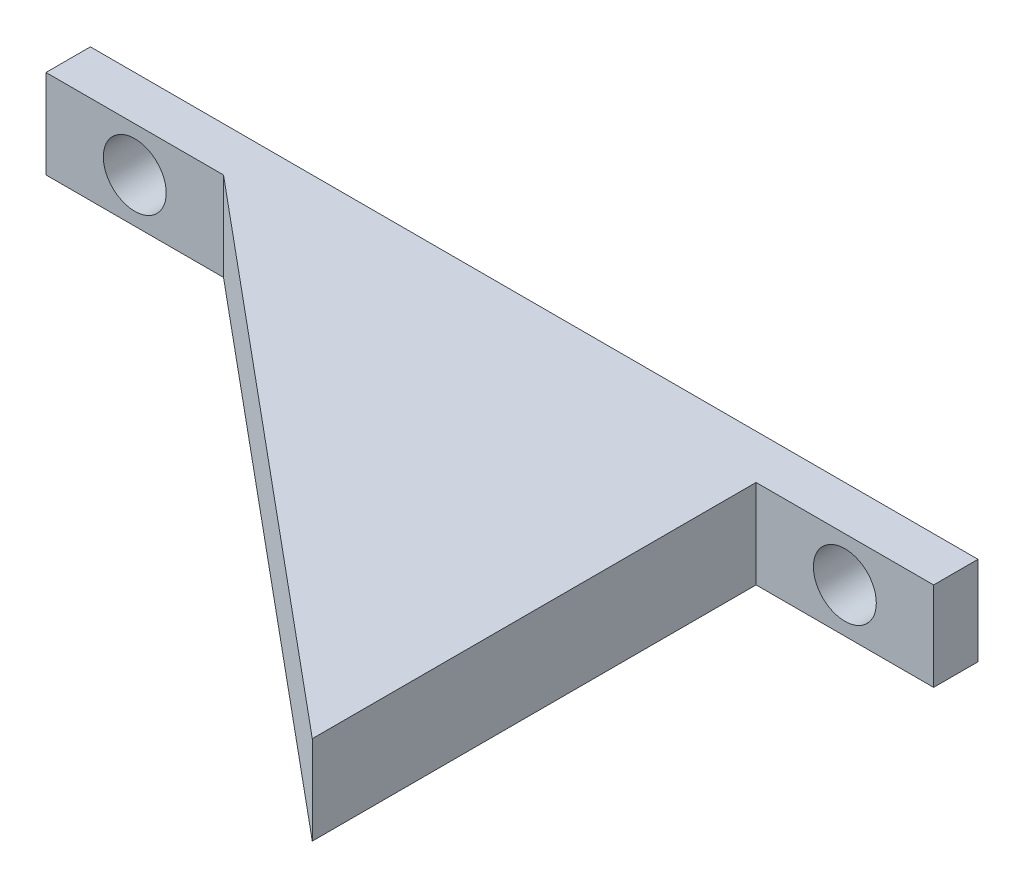
ISO-10303-21;
HEADER;
FILE_DESCRIPTION(('STEP AP214'),'2;1');
FILE_NAME('part.step','',(''),(''),'','','');
FILE_SCHEMA(('AUTOMOTIVE_DESIGN { 1 0 10303 214 1 1 1 1 }'));
ENDSEC;
DATA;
#1=APPLICATION_CONTEXT('core data for automotive mechanical design processes');
#2=APPLICATION_PROTOCOL_DEFINITION('international standard','automotive_design',2000,#1);
#3=PRODUCT_CONTEXT('',#1,'mechanical');
#4=PRODUCT('Part','Part','',(#3));
#5=PRODUCT_RELATED_PRODUCT_CATEGORY('part','',(#4));
#6=PRODUCT_DEFINITION_FORMATION('','',#4);
#7=PRODUCT_DEFINITION_CONTEXT('part definition',#1,'design');
#8=PRODUCT_DEFINITION('design','',#6,#7);
#9=PRODUCT_DEFINITION_SHAPE('','',#8);
#10=(LENGTH_UNIT() NAMED_UNIT(*) SI_UNIT(.MILLI.,.METRE.));
#11=(NAMED_UNIT(*) PLANE_ANGLE_UNIT() SI_UNIT($,.RADIAN.));
#12=(NAMED_UNIT(*) SI_UNIT($,.STERADIAN.) SOLID_ANGLE_UNIT());
#13=UNCERTAINTY_MEASURE_WITH_UNIT(LENGTH_MEASURE(1.E-05),#10,'distance_accuracy_value','');
#14=(GEOMETRIC_REPRESENTATION_CONTEXT(3) GLOBAL_UNCERTAINTY_ASSIGNED_CONTEXT((#13)) GLOBAL_UNIT_ASSIGNED_CONTEXT((#10,
#11,#12)) REPRESENTATION_CONTEXT('',''));
#15=CARTESIAN_POINT('',(0.,0.,0.));
#16=DIRECTION('',(0.,0.,1.));
#17=DIRECTION('',(1.,0.,0.));
#18=AXIS2_PLACEMENT_3D('',#15,#16,#17);
#19=CARTESIAN_POINT('',(-31.75,3.175,1.5875));
#20=DIRECTION('',(0.,0.,-1.));
#21=DIRECTION('',(-1.,0.,0.));
#22=AXIS2_PLACEMENT_3D('',#19,#20,#21);
#23=PLANE('',#22);
#24=CARTESIAN_POINT('',(25.4,0.,1.5875));
#25=DIRECTION('',(0.,0.,1.));
#26=DIRECTION('',(1.,0.,0.));
#27=AXIS2_PLACEMENT_3D('',#24,#25,#26);
#28=CIRCLE('',#27,2.2499955);
#29=CARTESIAN_POINT('',(27.6499955,0.,1.5875));
#30=VERTEX_POINT('',#29);
#31=EDGE_CURVE('E126',#30,#30,#28,.T.);
#32=ORIENTED_EDGE('',*,*,#31,.F.);
#33=EDGE_LOOP('',(#32));
#34=FACE_BOUND('',#33,.T.);
#35=DIRECTION('',(0.,1.,0.));
#36=VECTOR('',#35,1.);
#37=CARTESIAN_POINT('',(19.05,-52.7700854420073,1.5875));
#38=LINE('',#37,#36);
#39=CARTESIAN_POINT('',(19.05,-3.175,1.5875));
#40=VERTEX_POINT('',#39);
#41=CARTESIAN_POINT('',(19.05,3.175,1.5875));
#42=VERTEX_POINT('',#41);
#43=EDGE_CURVE('E110',#40,#42,#38,.T.);
#44=ORIENTED_EDGE('',*,*,#43,.F.);
#45=DIRECTION('',(1.,0.,0.));
#46=VECTOR('',#45,1.);
#47=CARTESIAN_POINT('',(-31.75,-3.175,1.5875));
#48=LINE('',#47,#46);
#49=CARTESIAN_POINT('',(31.75,-3.175,1.5875));
#50=VERTEX_POINT('',#49);
#51=EDGE_CURVE('E80',#40,#50,#48,.T.);
#52=ORIENTED_EDGE('',*,*,#51,.T.);
#53=DIRECTION('',(0.,-1.,0.));
#54=VECTOR('',#53,1.);
#55=CARTESIAN_POINT('',(31.75,3.175,1.5875));
#56=LINE('',#55,#54);
#57=CARTESIAN_POINT('',(31.75,3.175,1.5875));
#58=VERTEX_POINT('',#57);
#59=EDGE_CURVE('E148',#58,#50,#56,.T.);
#60=ORIENTED_EDGE('',*,*,#59,.F.);
#61=DIRECTION('',(1.,0.,0.));
#62=VECTOR('',#61,1.);
#63=CARTESIAN_POINT('',(-31.75,3.175,1.5875));
#64=LINE('',#63,#62);
#65=EDGE_CURVE('E58',#42,#58,#64,.T.);
#66=ORIENTED_EDGE('',*,*,#65,.F.);
#67=EDGE_LOOP('',(#44,#52,#60,#66));
#68=FACE_BOUND('',#67,.T.);
#69=ADVANCED_FACE('F34',(#34,#68),#23,.F.);
#70=CARTESIAN_POINT('',(31.75,3.175,1.5875));
#71=DIRECTION('',(-1.,0.,0.));
#72=DIRECTION('',(0.,0.,1.));
#73=AXIS2_PLACEMENT_3D('',#70,#71,#72);
#74=PLANE('',#73);
#75=DIRECTION('',(0.,0.,-1.));
#76=VECTOR('',#75,1.);
#77=CARTESIAN_POINT('',(31.75,-3.175,1.5875));
#78=LINE('',#77,#76);
#79=CARTESIAN_POINT('',(31.75,-3.175,-1.5875));
#80=VERTEX_POINT('',#79);
#81=EDGE_CURVE('E130',#50,#80,#78,.T.);
#82=ORIENTED_EDGE('',*,*,#81,.T.);
#83=DIRECTION('',(0.,-1.,0.));
#84=VECTOR('',#83,1.);
#85=CARTESIAN_POINT('',(31.75,3.175,-1.5875));
#86=LINE('',#85,#84);
#87=CARTESIAN_POINT('',(31.75,3.175,-1.5875));
#88=VERTEX_POINT('',#87);
#89=EDGE_CURVE('E11',#88,#80,#86,.T.);
#90=ORIENTED_EDGE('',*,*,#89,.F.);
#91=DIRECTION('',(0.,0.,-1.));
#92=VECTOR('',#91,1.);
#93=CARTESIAN_POINT('',(31.75,3.175,1.5875));
#94=LINE('',#93,#92);
#95=EDGE_CURVE('E139',#58,#88,#94,.T.);
#96=ORIENTED_EDGE('',*,*,#95,.F.);
#97=ORIENTED_EDGE('',*,*,#59,.T.);
#98=EDGE_LOOP('',(#82,#90,#96,#97));
#99=FACE_BOUND('',#98,.T.);
#100=ADVANCED_FACE('F36',(#99),#74,.F.);
#101=CARTESIAN_POINT('',(-31.75,3.175,-1.5875));
#102=DIRECTION('',(0.,0.,1.));
#103=DIRECTION('',(1.,0.,0.));
#104=AXIS2_PLACEMENT_3D('',#101,#102,#103);
#105=PLANE('',#104);
#106=CARTESIAN_POINT('',(-25.4,0.,-1.5875));
#107=DIRECTION('',(0.,0.,1.));
#108=DIRECTION('',(1.,0.,0.));
#109=AXIS2_PLACEMENT_3D('',#106,#107,#108);
#110=CIRCLE('',#109,2.2499955);
#111=CARTESIAN_POINT('',(-23.1500045,0.,-1.5875));
#112=VERTEX_POINT('',#111);
#113=EDGE_CURVE('E127',#112,#112,#110,.T.);
#114=ORIENTED_EDGE('',*,*,#113,.T.);
#115=EDGE_LOOP('',(#114));
#116=FACE_BOUND('',#115,.T.);
#117=CARTESIAN_POINT('',(25.4,0.,-1.5875));
#118=DIRECTION('',(0.,0.,1.));
#119=DIRECTION('',(1.,0.,0.));
#120=AXIS2_PLACEMENT_3D('',#117,#118,#119);
#121=CIRCLE('',#120,2.2499955);
#122=CARTESIAN_POINT('',(27.6499955,0.,-1.5875));
#123=VERTEX_POINT('',#122);
#124=EDGE_CURVE('E134',#123,#123,#121,.T.);
#125=ORIENTED_EDGE('',*,*,#124,.T.);
#126=EDGE_LOOP('',(#125));
#127=FACE_BOUND('',#126,.T.);
#128=DIRECTION('',(-1.,0.,0.));
#129=VECTOR('',#128,1.);
#130=CARTESIAN_POINT('',(-31.75,-3.175,-1.5875));
#131=LINE('',#130,#129);
#132=CARTESIAN_POINT('',(-31.75,-3.175,-1.5875));
#133=VERTEX_POINT('',#132);
#134=EDGE_CURVE('E151',#80,#133,#131,.T.);
#135=ORIENTED_EDGE('',*,*,#134,.T.);
#136=DIRECTION('',(0.,-1.,0.));
#137=VECTOR('',#136,1.);
#138=CARTESIAN_POINT('',(-31.75,3.175,-1.5875));
#139=LINE('',#138,#137);
#140=CARTESIAN_POINT('',(-31.75,3.175,-1.5875));
#141=VERTEX_POINT('',#140);
#142=EDGE_CURVE('E42',#141,#133,#139,.T.);
#143=ORIENTED_EDGE('',*,*,#142,.F.);
#144=DIRECTION('',(-1.,0.,0.));
#145=VECTOR('',#144,1.);
#146=CARTESIAN_POINT('',(-31.75,3.175,-1.5875));
#147=LINE('',#146,#145);
#148=EDGE_CURVE('E87',#88,#141,#147,.T.);
#149=ORIENTED_EDGE('',*,*,#148,.F.);
#150=ORIENTED_EDGE('',*,*,#89,.T.);
#151=EDGE_LOOP('',(#135,#143,#149,#150));
#152=FACE_BOUND('',#151,.T.);
#153=ADVANCED_FACE('F172',(#116,#127,#152),#105,.F.);
#154=CARTESIAN_POINT('',(-31.75,3.175,1.5875));
#155=DIRECTION('',(1.,0.,0.));
#156=DIRECTION('',(0.,0.,-1.));
#157=AXIS2_PLACEMENT_3D('',#154,#155,#156);
#158=PLANE('',#157);
#159=DIRECTION('',(0.,0.,1.));
#160=VECTOR('',#159,1.);
#161=CARTESIAN_POINT('',(-31.75,-3.175,1.5875));
#162=LINE('',#161,#160);
#163=CARTESIAN_POINT('',(-31.75,-3.175,1.5875));
#164=VERTEX_POINT('',#163);
#165=EDGE_CURVE('E153',#133,#164,#162,.T.);
#166=ORIENTED_EDGE('',*,*,#165,.T.);
#167=DIRECTION('',(0.,-1.,0.));
#168=VECTOR('',#167,1.);
#169=CARTESIAN_POINT('',(-31.75,3.175,1.5875));
#170=LINE('',#169,#168);
#171=CARTESIAN_POINT('',(-31.75,3.175,1.5875));
#172=VERTEX_POINT('',#171);
#173=EDGE_CURVE('E157',#172,#164,#170,.T.);
#174=ORIENTED_EDGE('',*,*,#173,.F.);
#175=DIRECTION('',(0.,0.,1.));
#176=VECTOR('',#175,1.);
#177=CARTESIAN_POINT('',(-31.75,3.175,1.5875));
#178=LINE('',#177,#176);
#179=EDGE_CURVE('E143',#141,#172,#178,.T.);
#180=ORIENTED_EDGE('',*,*,#179,.F.);
#181=ORIENTED_EDGE('',*,*,#142,.T.);
#182=EDGE_LOOP('',(#166,#174,#180,#181));
#183=FACE_BOUND('',#182,.T.);
#184=ADVANCED_FACE('F163',(#183),#158,.F.);
#185=CARTESIAN_POINT('',(-25.4,0.,1.5875));
#186=DIRECTION('',(0.,0.,1.));
#187=DIRECTION('',(1.,0.,0.));
#188=AXIS2_PLACEMENT_3D('',#185,#186,#187);
#189=CIRCLE('',#188,2.2499955);
#190=CARTESIAN_POINT('',(-23.1500045,0.,1.5875));
#191=VERTEX_POINT('',#190);
#192=EDGE_CURVE('E131',#191,#191,#189,.T.);
#193=ORIENTED_EDGE('',*,*,#192,.F.);
#194=EDGE_LOOP('',(#193));
#195=FACE_BOUND('',#194,.T.);
#196=CARTESIAN_POINT('',(-19.05,-3.175,1.5875));
#197=VERTEX_POINT('',#196);
#198=EDGE_CURVE('E141',#164,#197,#48,.T.);
#199=ORIENTED_EDGE('',*,*,#198,.T.);
#200=DIRECTION('',(0.,1.,0.));
#201=VECTOR('',#200,1.);
#202=CARTESIAN_POINT('',(-19.05,-52.7700854420073,1.5875));
#203=LINE('',#202,#201);
#204=CARTESIAN_POINT('',(-19.05,3.175,1.5875));
#205=VERTEX_POINT('',#204);
#206=EDGE_CURVE('E118',#197,#205,#203,.T.);
#207=ORIENTED_EDGE('',*,*,#206,.T.);
#208=EDGE_CURVE('E145',#172,#205,#64,.T.);
#209=ORIENTED_EDGE('',*,*,#208,.F.);
#210=ORIENTED_EDGE('',*,*,#173,.T.);
#211=EDGE_LOOP('',(#199,#207,#209,#210));
#212=FACE_BOUND('',#211,.T.);
#213=ADVANCED_FACE('F166',(#195,#212),#23,.F.);
#214=CARTESIAN_POINT('',(0.,3.175,0.));
#215=DIRECTION('',(0.,-1.,0.));
#216=DIRECTION('',(0.,0.,-1.));
#217=AXIS2_PLACEMENT_3D('',#214,#215,#216);
#218=PLANE('',#217);
#219=ORIENTED_EDGE('',*,*,#95,.T.);
#220=ORIENTED_EDGE('',*,*,#148,.T.);
#221=ORIENTED_EDGE('',*,*,#179,.T.);
#222=ORIENTED_EDGE('',*,*,#208,.T.);
#223=DIRECTION('',(0.768221279597376,0.,0.64018439966448));
#224=VECTOR('',#223,1.);
#225=CARTESIAN_POINT('',(19.05,3.175,33.3375));
#226=LINE('',#225,#224);
#227=CARTESIAN_POINT('',(19.05,3.175,33.3375));
#228=VERTEX_POINT('',#227);
#229=EDGE_CURVE('E49',#205,#228,#226,.T.);
#230=ORIENTED_EDGE('',*,*,#229,.T.);
#231=DIRECTION('',(0.,0.,-1.));
#232=VECTOR('',#231,1.);
#233=CARTESIAN_POINT('',(19.05,3.175,1.5875));
#234=LINE('',#233,#232);
#235=EDGE_CURVE('E115',#228,#42,#234,.T.);
#236=ORIENTED_EDGE('',*,*,#235,.T.);
#237=ORIENTED_EDGE('',*,*,#65,.T.);
#238=EDGE_LOOP('',(#219,#220,#221,#222,#230,#236,#237));
#239=FACE_BOUND('',#238,.T.);
#240=ADVANCED_FACE('F168',(#239),#218,.F.);
#241=CARTESIAN_POINT('',(0.,-3.175,0.));
#242=DIRECTION('',(0.,-1.,0.));
#243=DIRECTION('',(0.,0.,-1.));
#244=AXIS2_PLACEMENT_3D('',#241,#242,#243);
#245=PLANE('',#244);
#246=ORIENTED_EDGE('',*,*,#81,.F.);
#247=ORIENTED_EDGE('',*,*,#51,.F.);
#248=DIRECTION('',(0.,0.,-1.));
#249=VECTOR('',#248,1.);
#250=CARTESIAN_POINT('',(19.05,-3.175,1.5875));
#251=LINE('',#250,#249);
#252=CARTESIAN_POINT('',(19.05,-3.175,33.3375));
#253=VERTEX_POINT('',#252);
#254=EDGE_CURVE('E102',#253,#40,#251,.T.);
#255=ORIENTED_EDGE('',*,*,#254,.F.);
#256=DIRECTION('',(0.768221279597376,0.,0.64018439966448));
#257=VECTOR('',#256,1.);
#258=CARTESIAN_POINT('',(19.05,-3.175,33.3375));
#259=LINE('',#258,#257);
#260=EDGE_CURVE('E108',#197,#253,#259,.T.);
#261=ORIENTED_EDGE('',*,*,#260,.F.);
#262=ORIENTED_EDGE('',*,*,#198,.F.);
#263=ORIENTED_EDGE('',*,*,#165,.F.);
#264=ORIENTED_EDGE('',*,*,#134,.F.);
#265=EDGE_LOOP('',(#246,#247,#255,#261,#262,#263,#264));
#266=FACE_BOUND('',#265,.T.);
#267=ADVANCED_FACE('F105',(#266),#245,.T.);
#268=CARTESIAN_POINT('',(25.4,0.,-1.5875));
#269=DIRECTION('',(0.,0.,1.));
#270=DIRECTION('',(1.,0.,0.));
#271=AXIS2_PLACEMENT_3D('',#268,#269,#270);
#272=CYLINDRICAL_SURFACE('',#271,2.2499955);
#273=ORIENTED_EDGE('',*,*,#124,.F.);
#274=EDGE_LOOP('',(#273));
#275=FACE_BOUND('',#274,.T.);
#276=ORIENTED_EDGE('',*,*,#31,.T.);
#277=EDGE_LOOP('',(#276));
#278=FACE_BOUND('',#277,.T.);
#279=ADVANCED_FACE('F198',(#275,#278),#272,.F.);
#280=CARTESIAN_POINT('',(-25.4,0.,-1.5875));
#281=DIRECTION('',(0.,0.,1.));
#282=DIRECTION('',(1.,0.,0.));
#283=AXIS2_PLACEMENT_3D('',#280,#281,#282);
#284=CYLINDRICAL_SURFACE('',#283,2.2499955);
#285=ORIENTED_EDGE('',*,*,#113,.F.);
#286=EDGE_LOOP('',(#285));
#287=FACE_BOUND('',#286,.T.);
#288=ORIENTED_EDGE('',*,*,#192,.T.);
#289=EDGE_LOOP('',(#288));
#290=FACE_BOUND('',#289,.T.);
#291=ADVANCED_FACE('F196',(#287,#290),#284,.F.);
#292=CARTESIAN_POINT('',(19.05,-52.7700854420073,33.3375));
#293=DIRECTION('',(-0.64018439966448,0.,0.768221279597376));
#294=DIRECTION('',(0.768221279597376,0.,0.64018439966448));
#295=AXIS2_PLACEMENT_3D('',#292,#293,#294);
#296=PLANE('',#295);
#297=ORIENTED_EDGE('',*,*,#206,.F.);
#298=ORIENTED_EDGE('',*,*,#260,.T.);
#299=DIRECTION('',(0.,1.,0.));
#300=VECTOR('',#299,1.);
#301=CARTESIAN_POINT('',(19.05,-52.7700854420073,33.3375));
#302=LINE('',#301,#300);
#303=EDGE_CURVE('E111',#253,#228,#302,.T.);
#304=ORIENTED_EDGE('',*,*,#303,.T.);
#305=ORIENTED_EDGE('',*,*,#229,.F.);
#306=EDGE_LOOP('',(#297,#298,#304,#305));
#307=FACE_BOUND('',#306,.T.);
#308=ADVANCED_FACE('F117',(#307),#296,.T.);
#309=CARTESIAN_POINT('',(19.05,-52.7700854420073,1.5875));
#310=DIRECTION('',(1.,0.,0.));
#311=DIRECTION('',(0.,0.,-1.));
#312=AXIS2_PLACEMENT_3D('',#309,#310,#311);
#313=PLANE('',#312);
#314=ORIENTED_EDGE('',*,*,#303,.F.);
#315=ORIENTED_EDGE('',*,*,#254,.T.);
#316=ORIENTED_EDGE('',*,*,#43,.T.);
#317=ORIENTED_EDGE('',*,*,#235,.F.);
#318=EDGE_LOOP('',(#314,#315,#316,#317));
#319=FACE_BOUND('',#318,.T.);
#320=ADVANCED_FACE('F114',(#319),#313,.T.);
#321=CLOSED_SHELL('',(#69,#100,#153,#184,#213,#240,#267,#279,#291,#308,#320));
#322=MANIFOLD_SOLID_BREP('B2',#321);
#323=ADVANCED_BREP_SHAPE_REPRESENTATION('',(#18,#322),#14);
#324=SHAPE_DEFINITION_REPRESENTATION(#9,#323);
ENDSEC;
END-ISO-10303-21;
